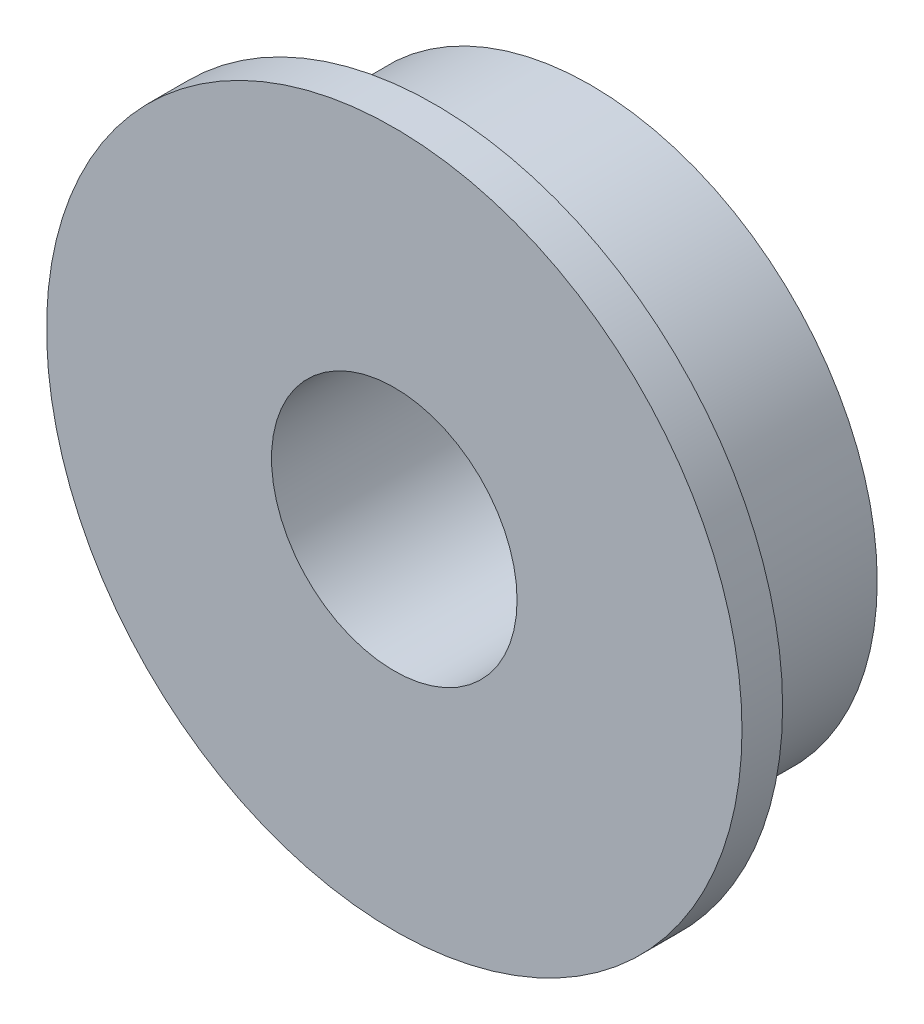
ISO-10303-21;
HEADER;
FILE_DESCRIPTION(('STEP AP214'),'2;1');
FILE_NAME('part.step','',(''),(''),'','','');
FILE_SCHEMA(('AUTOMOTIVE_DESIGN { 1 0 10303 214 1 1 1 1 }'));
ENDSEC;
DATA;
#1=APPLICATION_CONTEXT('core data for automotive mechanical design processes');
#2=APPLICATION_PROTOCOL_DEFINITION('international standard','automotive_design',2000,#1);
#3=PRODUCT_CONTEXT('',#1,'mechanical');
#4=PRODUCT('Part','Part','',(#3));
#5=PRODUCT_RELATED_PRODUCT_CATEGORY('part','',(#4));
#6=PRODUCT_DEFINITION_FORMATION('','',#4);
#7=PRODUCT_DEFINITION_CONTEXT('part definition',#1,'design');
#8=PRODUCT_DEFINITION('design','',#6,#7);
#9=PRODUCT_DEFINITION_SHAPE('','',#8);
#10=(LENGTH_UNIT() NAMED_UNIT(*) SI_UNIT(.MILLI.,.METRE.));
#11=(NAMED_UNIT(*) PLANE_ANGLE_UNIT() SI_UNIT($,.RADIAN.));
#12=(NAMED_UNIT(*) SI_UNIT($,.STERADIAN.) SOLID_ANGLE_UNIT());
#13=UNCERTAINTY_MEASURE_WITH_UNIT(LENGTH_MEASURE(1.E-05),#10,'distance_accuracy_value','');
#14=(GEOMETRIC_REPRESENTATION_CONTEXT(3) GLOBAL_UNCERTAINTY_ASSIGNED_CONTEXT((#13)) GLOBAL_UNIT_ASSIGNED_CONTEXT((#10,
#11,#12)) REPRESENTATION_CONTEXT('',''));
#15=CARTESIAN_POINT('',(0.,0.,0.));
#16=DIRECTION('',(0.,0.,1.));
#17=DIRECTION('',(1.,0.,0.));
#18=AXIS2_PLACEMENT_3D('',#15,#16,#17);
#19=CARTESIAN_POINT('',(0.,0.,1.5748));
#20=DIRECTION('',(0.,0.,-1.));
#21=DIRECTION('',(-1.,0.,0.));
#22=AXIS2_PLACEMENT_3D('',#19,#20,#21);
#23=CYLINDRICAL_SURFACE('',#22,11.1125);
#24=CARTESIAN_POINT('',(0.,0.,0.));
#25=DIRECTION('',(0.,0.,-1.));
#26=DIRECTION('',(-1.,0.,0.));
#27=AXIS2_PLACEMENT_3D('',#24,#25,#26);
#28=CIRCLE('',#27,11.1125);
#29=CARTESIAN_POINT('',(-11.1125,0.,0.));
#30=VERTEX_POINT('',#29);
#31=EDGE_CURVE('E18',#30,#30,#28,.F.);
#32=ORIENTED_EDGE('',*,*,#31,.F.);
#33=EDGE_LOOP('',(#32));
#34=FACE_BOUND('',#33,.T.);
#35=CARTESIAN_POINT('',(0.,0.,-6.0452));
#36=DIRECTION('',(0.,0.,-1.));
#37=DIRECTION('',(-1.,0.,0.));
#38=AXIS2_PLACEMENT_3D('',#35,#36,#37);
#39=CIRCLE('',#38,11.1125);
#40=CARTESIAN_POINT('',(-11.1125,0.,-6.0452));
#41=VERTEX_POINT('',#40);
#42=EDGE_CURVE('E34',#41,#41,#39,.T.);
#43=ORIENTED_EDGE('',*,*,#42,.F.);
#44=EDGE_LOOP('',(#43));
#45=FACE_BOUND('',#44,.T.);
#46=ADVANCED_FACE('F15',(#34,#45),#23,.T.);
#47=CARTESIAN_POINT('',(0.,0.,0.));
#48=DIRECTION('',(0.,0.,-1.));
#49=DIRECTION('',(-1.,0.,0.));
#50=AXIS2_PLACEMENT_3D('',#47,#48,#49);
#51=PLANE('',#50);
#52=ORIENTED_EDGE('',*,*,#31,.T.);
#53=EDGE_LOOP('',(#52));
#54=FACE_BOUND('',#53,.T.);
#55=CARTESIAN_POINT('',(0.,0.,0.));
#56=DIRECTION('',(0.,0.,1.));
#57=DIRECTION('',(1.,0.,0.));
#58=AXIS2_PLACEMENT_3D('',#55,#56,#57);
#59=CIRCLE('',#58,13.4874);
#60=CARTESIAN_POINT('',(13.4874,0.,0.));
#61=VERTEX_POINT('',#60);
#62=EDGE_CURVE('E32',#61,#61,#59,.T.);
#63=ORIENTED_EDGE('',*,*,#62,.F.);
#64=EDGE_LOOP('',(#63));
#65=FACE_BOUND('',#64,.T.);
#66=ADVANCED_FACE('F41',(#54,#65),#51,.T.);
#67=CARTESIAN_POINT('',(0.,0.,-6.0452));
#68=DIRECTION('',(0.,0.,-1.));
#69=DIRECTION('',(-1.,0.,0.));
#70=AXIS2_PLACEMENT_3D('',#67,#68,#69);
#71=PLANE('',#70);
#72=CARTESIAN_POINT('',(0.,0.,-6.0452));
#73=DIRECTION('',(0.,0.,1.));
#74=DIRECTION('',(1.,0.,0.));
#75=AXIS2_PLACEMENT_3D('',#72,#73,#74);
#76=CIRCLE('',#75,4.7625);
#77=CARTESIAN_POINT('',(4.7625,0.,-6.0452));
#78=VERTEX_POINT('',#77);
#79=EDGE_CURVE('E27',#78,#78,#76,.T.);
#80=ORIENTED_EDGE('',*,*,#79,.T.);
#81=EDGE_LOOP('',(#80));
#82=FACE_BOUND('',#81,.T.);
#83=ORIENTED_EDGE('',*,*,#42,.T.);
#84=EDGE_LOOP('',(#83));
#85=FACE_BOUND('',#84,.T.);
#86=ADVANCED_FACE('F50',(#82,#85),#71,.T.);
#87=CARTESIAN_POINT('',(0.,0.,0.));
#88=DIRECTION('',(0.,0.,1.));
#89=DIRECTION('',(1.,0.,0.));
#90=AXIS2_PLACEMENT_3D('',#87,#88,#89);
#91=CYLINDRICAL_SURFACE('',#90,13.4874);
#92=ORIENTED_EDGE('',*,*,#62,.T.);
#93=EDGE_LOOP('',(#92));
#94=FACE_BOUND('',#93,.T.);
#95=CARTESIAN_POINT('',(0.,0.,1.5748));
#96=DIRECTION('',(0.,0.,1.));
#97=DIRECTION('',(1.,0.,0.));
#98=AXIS2_PLACEMENT_3D('',#95,#96,#97);
#99=CIRCLE('',#98,13.4874);
#100=CARTESIAN_POINT('',(13.4874,0.,1.5748));
#101=VERTEX_POINT('',#100);
#102=EDGE_CURVE('E22',#101,#101,#99,.F.);
#103=ORIENTED_EDGE('',*,*,#102,.T.);
#104=EDGE_LOOP('',(#103));
#105=FACE_BOUND('',#104,.T.);
#106=ADVANCED_FACE('F59',(#94,#105),#91,.T.);
#107=CARTESIAN_POINT('',(0.,0.,-6.0452));
#108=DIRECTION('',(0.,0.,1.));
#109=DIRECTION('',(1.,0.,0.));
#110=AXIS2_PLACEMENT_3D('',#107,#108,#109);
#111=CYLINDRICAL_SURFACE('',#110,4.7625);
#112=CARTESIAN_POINT('',(0.,0.,1.5748));
#113=DIRECTION('',(0.,0.,1.));
#114=DIRECTION('',(1.,0.,0.));
#115=AXIS2_PLACEMENT_3D('',#112,#113,#114);
#116=CIRCLE('',#115,4.7625);
#117=CARTESIAN_POINT('',(4.7625,0.,1.5748));
#118=VERTEX_POINT('',#117);
#119=EDGE_CURVE('E10',#118,#118,#116,.T.);
#120=ORIENTED_EDGE('',*,*,#119,.T.);
#121=EDGE_LOOP('',(#120));
#122=FACE_BOUND('',#121,.T.);
#123=ORIENTED_EDGE('',*,*,#79,.F.);
#124=EDGE_LOOP('',(#123));
#125=FACE_BOUND('',#124,.T.);
#126=ADVANCED_FACE('F53',(#122,#125),#111,.F.);
#127=CARTESIAN_POINT('',(0.,0.,1.5748));
#128=DIRECTION('',(0.,0.,-1.));
#129=DIRECTION('',(-1.,0.,0.));
#130=AXIS2_PLACEMENT_3D('',#127,#128,#129);
#131=PLANE('',#130);
#132=ORIENTED_EDGE('',*,*,#119,.F.);
#133=EDGE_LOOP('',(#132));
#134=FACE_BOUND('',#133,.T.);
#135=ORIENTED_EDGE('',*,*,#102,.F.);
#136=EDGE_LOOP('',(#135));
#137=FACE_BOUND('',#136,.T.);
#138=ADVANCED_FACE('F51',(#134,#137),#131,.F.);
#139=CLOSED_SHELL('',(#46,#66,#86,#106,#126,#138));
#140=MANIFOLD_SOLID_BREP('B1',#139);
#141=ADVANCED_BREP_SHAPE_REPRESENTATION('',(#18,#140),#14);
#142=SHAPE_DEFINITION_REPRESENTATION(#9,#141);
ENDSEC;
END-ISO-10303-21;
